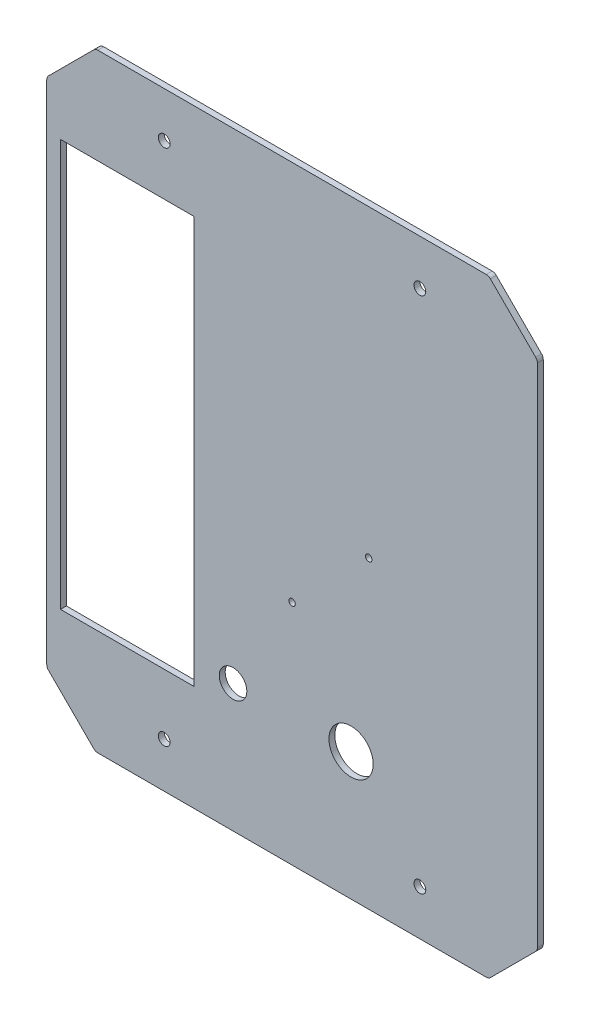
ISO-10303-21;
HEADER;
FILE_DESCRIPTION(('STEP AP214'),'2;1');
FILE_NAME('part.step','',(''),(''),'','','');
FILE_SCHEMA(('AUTOMOTIVE_DESIGN { 1 0 10303 214 1 1 1 1 }'));
ENDSEC;
DATA;
#1=APPLICATION_CONTEXT('core data for automotive mechanical design processes');
#2=APPLICATION_PROTOCOL_DEFINITION('international standard','automotive_design',2000,#1);
#3=PRODUCT_CONTEXT('',#1,'mechanical');
#4=PRODUCT('Part','Part','',(#3));
#5=PRODUCT_RELATED_PRODUCT_CATEGORY('part','',(#4));
#6=PRODUCT_DEFINITION_FORMATION('','',#4);
#7=PRODUCT_DEFINITION_CONTEXT('part definition',#1,'design');
#8=PRODUCT_DEFINITION('design','',#6,#7);
#9=PRODUCT_DEFINITION_SHAPE('','',#8);
#10=(LENGTH_UNIT() NAMED_UNIT(*) SI_UNIT(.MILLI.,.METRE.));
#11=(NAMED_UNIT(*) PLANE_ANGLE_UNIT() SI_UNIT($,.RADIAN.));
#12=(NAMED_UNIT(*) SI_UNIT($,.STERADIAN.) SOLID_ANGLE_UNIT());
#13=UNCERTAINTY_MEASURE_WITH_UNIT(LENGTH_MEASURE(1.E-05),#10,'distance_accuracy_value','');
#14=(GEOMETRIC_REPRESENTATION_CONTEXT(3) GLOBAL_UNCERTAINTY_ASSIGNED_CONTEXT((#13)) GLOBAL_UNIT_ASSIGNED_CONTEXT((#10,
#11,#12)) REPRESENTATION_CONTEXT('',''));
#15=CARTESIAN_POINT('',(0.,0.,0.));
#16=DIRECTION('',(0.,0.,1.));
#17=DIRECTION('',(1.,0.,0.));
#18=AXIS2_PLACEMENT_3D('',#15,#16,#17);
#19=CARTESIAN_POINT('',(24.7487373415291,24.7487373415292,3.));
#20=DIRECTION('',(-0.707106781186548,0.707106781186547,0.));
#21=DIRECTION('',(-0.707106781186547,-0.707106781186548,0.));
#22=AXIS2_PLACEMENT_3D('',#19,#20,#21);
#23=PLANE('',#22);
#24=DIRECTION('',(0.707106781186547,0.707106781186548,0.));
#25=VECTOR('',#24,1.);
#26=CARTESIAN_POINT('',(24.7487373415291,24.7487373415292,0.));
#27=LINE('',#26,#25);
#28=CARTESIAN_POINT('',(0.87867965644035,0.87867965644035,0.));
#29=VERTEX_POINT('',#28);
#30=CARTESIAN_POINT('',(23.8700576850888,23.8700576850888,0.));
#31=VERTEX_POINT('',#30);
#32=EDGE_CURVE('E259',#29,#31,#27,.T.);
#33=ORIENTED_EDGE('',*,*,#32,.T.);
#34=DIRECTION('',(0.,0.,-1.));
#35=VECTOR('',#34,1.);
#36=CARTESIAN_POINT('',(23.8700576850888,23.8700576850888,3.));
#37=LINE('',#36,#35);
#38=CARTESIAN_POINT('',(23.8700576850888,23.8700576850888,3.));
#39=VERTEX_POINT('',#38);
#40=EDGE_CURVE('E11',#31,#39,#37,.F.);
#41=ORIENTED_EDGE('',*,*,#40,.T.);
#42=DIRECTION('',(0.707106781186547,0.707106781186548,0.));
#43=VECTOR('',#42,1.);
#44=CARTESIAN_POINT('',(24.7487373415291,24.7487373415292,3.));
#45=LINE('',#44,#43);
#46=CARTESIAN_POINT('',(0.87867965644035,0.87867965644035,3.));
#47=VERTEX_POINT('',#46);
#48=EDGE_CURVE('E262',#47,#39,#45,.T.);
#49=ORIENTED_EDGE('',*,*,#48,.F.);
#50=DIRECTION('',(0.,0.,-1.));
#51=VECTOR('',#50,1.);
#52=CARTESIAN_POINT('',(0.87867965644035,0.878679656440354,3.));
#53=LINE('',#52,#51);
#54=EDGE_CURVE('E49',#47,#29,#53,.T.);
#55=ORIENTED_EDGE('',*,*,#54,.T.);
#56=EDGE_LOOP('',(#33,#41,#49,#55));
#57=FACE_BOUND('',#56,.T.);
#58=ADVANCED_FACE('F41',(#57),#23,.F.);
#59=CARTESIAN_POINT('',(24.7487373415291,284.748737341529,3.));
#60=DIRECTION('',(-1.,0.,0.));
#61=DIRECTION('',(0.,-1.,0.));
#62=AXIS2_PLACEMENT_3D('',#59,#60,#61);
#63=PLANE('',#62);
#64=DIRECTION('',(0.,1.,0.));
#65=VECTOR('',#64,1.);
#66=CARTESIAN_POINT('',(24.7487373415291,284.748737341529,0.));
#67=LINE('',#66,#65);
#68=CARTESIAN_POINT('',(24.7487373415291,25.9913780286485,0.));
#69=VERTEX_POINT('',#68);
#70=CARTESIAN_POINT('',(24.7487373415291,283.50609665441,0.));
#71=VERTEX_POINT('',#70);
#72=EDGE_CURVE('E290',#69,#71,#67,.T.);
#73=ORIENTED_EDGE('',*,*,#72,.T.);
#74=DIRECTION('',(0.,0.,-1.));
#75=VECTOR('',#74,1.);
#76=CARTESIAN_POINT('',(24.7487373415291,283.50609665441,3.));
#77=LINE('',#76,#75);
#78=CARTESIAN_POINT('',(24.7487373415291,283.50609665441,3.));
#79=VERTEX_POINT('',#78);
#80=EDGE_CURVE('E374',#71,#79,#77,.F.);
#81=ORIENTED_EDGE('',*,*,#80,.T.);
#82=DIRECTION('',(0.,1.,0.));
#83=VECTOR('',#82,1.);
#84=CARTESIAN_POINT('',(24.7487373415291,284.748737341529,3.));
#85=LINE('',#84,#83);
#86=CARTESIAN_POINT('',(24.7487373415291,25.9913780286485,3.));
#87=VERTEX_POINT('',#86);
#88=EDGE_CURVE('E265',#87,#79,#85,.T.);
#89=ORIENTED_EDGE('',*,*,#88,.F.);
#90=DIRECTION('',(0.,0.,-1.));
#91=VECTOR('',#90,1.);
#92=CARTESIAN_POINT('',(24.7487373415291,25.9913780286485,3.));
#93=LINE('',#92,#91);
#94=EDGE_CURVE('E371',#87,#69,#93,.T.);
#95=ORIENTED_EDGE('',*,*,#94,.T.);
#96=EDGE_LOOP('',(#73,#81,#89,#95));
#97=FACE_BOUND('',#96,.T.);
#98=ADVANCED_FACE('F393',(#97),#63,.F.);
#99=CARTESIAN_POINT('',(0.,309.497474683058,3.));
#100=DIRECTION('',(-0.707106781186547,-0.707106781186548,0.));
#101=DIRECTION('',(0.707106781186548,-0.707106781186547,0.));
#102=AXIS2_PLACEMENT_3D('',#99,#100,#101);
#103=PLANE('',#102);
#104=DIRECTION('',(-0.707106781186548,0.707106781186547,0.));
#105=VECTOR('',#104,1.);
#106=CARTESIAN_POINT('',(0.,309.497474683058,0.));
#107=LINE('',#106,#105);
#108=CARTESIAN_POINT('',(23.8700576850888,285.62741699797,0.));
#109=VERTEX_POINT('',#108);
#110=CARTESIAN_POINT('',(0.878679656440274,308.618795026618,0.));
#111=VERTEX_POINT('',#110);
#112=EDGE_CURVE('E293',#109,#111,#107,.T.);
#113=ORIENTED_EDGE('',*,*,#112,.T.);
#114=DIRECTION('',(0.,0.,-1.));
#115=VECTOR('',#114,1.);
#116=CARTESIAN_POINT('',(0.878679656440274,308.618795026618,3.));
#117=LINE('',#116,#115);
#118=CARTESIAN_POINT('',(0.878679656440274,308.618795026618,3.));
#119=VERTEX_POINT('',#118);
#120=EDGE_CURVE('E369',#111,#119,#117,.F.);
#121=ORIENTED_EDGE('',*,*,#120,.T.);
#122=DIRECTION('',(-0.707106781186548,0.707106781186547,0.));
#123=VECTOR('',#122,1.);
#124=CARTESIAN_POINT('',(0.,309.497474683058,3.));
#125=LINE('',#124,#123);
#126=CARTESIAN_POINT('',(23.8700576850888,285.62741699797,3.));
#127=VERTEX_POINT('',#126);
#128=EDGE_CURVE('E269',#127,#119,#125,.T.);
#129=ORIENTED_EDGE('',*,*,#128,.F.);
#130=DIRECTION('',(0.,0.,-1.));
#131=VECTOR('',#130,1.);
#132=CARTESIAN_POINT('',(23.8700576850888,285.62741699797,3.));
#133=LINE('',#132,#131);
#134=EDGE_CURVE('E366',#127,#109,#133,.T.);
#135=ORIENTED_EDGE('',*,*,#134,.T.);
#136=EDGE_LOOP('',(#113,#121,#129,#135));
#137=FACE_BOUND('',#136,.T.);
#138=ADVANCED_FACE('F403',(#137),#103,.F.);
#139=CARTESIAN_POINT('',(-200.,309.497474683058,3.));
#140=DIRECTION('',(0.,-1.,0.));
#141=DIRECTION('',(0.,0.,-1.));
#142=AXIS2_PLACEMENT_3D('',#139,#140,#141);
#143=PLANE('',#142);
#144=DIRECTION('',(-1.,0.,0.));
#145=VECTOR('',#144,1.);
#146=CARTESIAN_POINT('',(-200.,309.497474683058,0.));
#147=LINE('',#146,#145);
#148=CARTESIAN_POINT('',(-1.24264068711938,309.497474683058,0.));
#149=VERTEX_POINT('',#148);
#150=CARTESIAN_POINT('',(-198.757359312881,309.497474683058,0.));
#151=VERTEX_POINT('',#150);
#152=EDGE_CURVE('E296',#149,#151,#147,.T.);
#153=ORIENTED_EDGE('',*,*,#152,.T.);
#154=DIRECTION('',(0.,0.,-1.));
#155=VECTOR('',#154,1.);
#156=CARTESIAN_POINT('',(-198.757359312881,309.497474683058,3.));
#157=LINE('',#156,#155);
#158=CARTESIAN_POINT('',(-198.757359312881,309.497474683058,3.));
#159=VERTEX_POINT('',#158);
#160=EDGE_CURVE('E364',#151,#159,#157,.F.);
#161=ORIENTED_EDGE('',*,*,#160,.T.);
#162=DIRECTION('',(-1.,0.,0.));
#163=VECTOR('',#162,1.);
#164=CARTESIAN_POINT('',(-200.,309.497474683058,3.));
#165=LINE('',#164,#163);
#166=CARTESIAN_POINT('',(-1.24264068711938,309.497474683058,3.));
#167=VERTEX_POINT('',#166);
#168=EDGE_CURVE('E272',#167,#159,#165,.T.);
#169=ORIENTED_EDGE('',*,*,#168,.F.);
#170=DIRECTION('',(0.,0.,-1.));
#171=VECTOR('',#170,1.);
#172=CARTESIAN_POINT('',(-1.24264068711938,309.497474683058,3.));
#173=LINE('',#172,#171);
#174=EDGE_CURVE('E361',#167,#149,#173,.T.);
#175=ORIENTED_EDGE('',*,*,#174,.T.);
#176=EDGE_LOOP('',(#153,#161,#169,#175));
#177=FACE_BOUND('',#176,.T.);
#178=ADVANCED_FACE('F412',(#177),#143,.F.);
#179=CARTESIAN_POINT('',(-224.748737341529,284.748737341529,3.));
#180=DIRECTION('',(0.707106781186549,-0.707106781186546,0.));
#181=DIRECTION('',(0.707106781186546,0.707106781186549,0.));
#182=AXIS2_PLACEMENT_3D('',#179,#180,#181);
#183=PLANE('',#182);
#184=DIRECTION('',(-0.707106781186546,-0.707106781186549,0.));
#185=VECTOR('',#184,1.);
#186=CARTESIAN_POINT('',(-224.748737341529,284.748737341529,0.));
#187=LINE('',#186,#185);
#188=CARTESIAN_POINT('',(-200.87867965644,308.618795026618,0.));
#189=VERTEX_POINT('',#188);
#190=CARTESIAN_POINT('',(-223.870057685089,285.62741699797,0.));
#191=VERTEX_POINT('',#190);
#192=EDGE_CURVE('E299',#189,#191,#187,.T.);
#193=ORIENTED_EDGE('',*,*,#192,.T.);
#194=DIRECTION('',(0.,0.,-1.));
#195=VECTOR('',#194,1.);
#196=CARTESIAN_POINT('',(-223.870057685089,285.62741699797,3.));
#197=LINE('',#196,#195);
#198=CARTESIAN_POINT('',(-223.870057685089,285.62741699797,3.));
#199=VERTEX_POINT('',#198);
#200=EDGE_CURVE('E359',#191,#199,#197,.F.);
#201=ORIENTED_EDGE('',*,*,#200,.T.);
#202=DIRECTION('',(-0.707106781186546,-0.707106781186549,0.));
#203=VECTOR('',#202,1.);
#204=CARTESIAN_POINT('',(-224.748737341529,284.748737341529,3.));
#205=LINE('',#204,#203);
#206=CARTESIAN_POINT('',(-200.87867965644,308.618795026618,3.));
#207=VERTEX_POINT('',#206);
#208=EDGE_CURVE('E275',#207,#199,#205,.T.);
#209=ORIENTED_EDGE('',*,*,#208,.F.);
#210=DIRECTION('',(0.,0.,-1.));
#211=VECTOR('',#210,1.);
#212=CARTESIAN_POINT('',(-200.87867965644,308.618795026618,3.));
#213=LINE('',#212,#211);
#214=EDGE_CURVE('E356',#207,#189,#213,.T.);
#215=ORIENTED_EDGE('',*,*,#214,.T.);
#216=EDGE_LOOP('',(#193,#201,#209,#215));
#217=FACE_BOUND('',#216,.T.);
#218=ADVANCED_FACE('F421',(#217),#183,.F.);
#219=CARTESIAN_POINT('',(-224.748737341529,24.7487373415292,3.));
#220=DIRECTION('',(1.,0.,0.));
#221=DIRECTION('',(0.,1.,0.));
#222=AXIS2_PLACEMENT_3D('',#219,#220,#221);
#223=PLANE('',#222);
#224=DIRECTION('',(0.,-1.,0.));
#225=VECTOR('',#224,1.);
#226=CARTESIAN_POINT('',(-224.748737341529,24.7487373415292,0.));
#227=LINE('',#226,#225);
#228=CARTESIAN_POINT('',(-224.748737341529,283.50609665441,0.));
#229=VERTEX_POINT('',#228);
#230=CARTESIAN_POINT('',(-224.748737341529,25.9913780286484,0.));
#231=VERTEX_POINT('',#230);
#232=EDGE_CURVE('E302',#229,#231,#227,.T.);
#233=ORIENTED_EDGE('',*,*,#232,.T.);
#234=DIRECTION('',(0.,0.,-1.));
#235=VECTOR('',#234,1.);
#236=CARTESIAN_POINT('',(-224.748737341529,25.9913780286484,3.));
#237=LINE('',#236,#235);
#238=CARTESIAN_POINT('',(-224.748737341529,25.9913780286484,3.));
#239=VERTEX_POINT('',#238);
#240=EDGE_CURVE('E354',#231,#239,#237,.F.);
#241=ORIENTED_EDGE('',*,*,#240,.T.);
#242=DIRECTION('',(0.,-1.,0.));
#243=VECTOR('',#242,1.);
#244=CARTESIAN_POINT('',(-224.748737341529,24.7487373415292,3.));
#245=LINE('',#244,#243);
#246=CARTESIAN_POINT('',(-224.748737341529,283.50609665441,3.));
#247=VERTEX_POINT('',#246);
#248=EDGE_CURVE('E278',#247,#239,#245,.T.);
#249=ORIENTED_EDGE('',*,*,#248,.F.);
#250=DIRECTION('',(0.,0.,-1.));
#251=VECTOR('',#250,1.);
#252=CARTESIAN_POINT('',(-224.748737341529,283.50609665441,3.));
#253=LINE('',#252,#251);
#254=EDGE_CURVE('E351',#247,#229,#253,.T.);
#255=ORIENTED_EDGE('',*,*,#254,.T.);
#256=EDGE_LOOP('',(#233,#241,#249,#255));
#257=FACE_BOUND('',#256,.T.);
#258=ADVANCED_FACE('F430',(#257),#223,.F.);
#259=CARTESIAN_POINT('',(-200.,0.,3.));
#260=DIRECTION('',(0.707106781186547,0.707106781186548,0.));
#261=DIRECTION('',(-0.707106781186548,0.707106781186547,0.));
#262=AXIS2_PLACEMENT_3D('',#259,#260,#261);
#263=PLANE('',#262);
#264=DIRECTION('',(0.707106781186548,-0.707106781186547,0.));
#265=VECTOR('',#264,1.);
#266=CARTESIAN_POINT('',(-200.,0.,0.));
#267=LINE('',#266,#265);
#268=CARTESIAN_POINT('',(-223.870057685089,23.8700576850888,0.));
#269=VERTEX_POINT('',#268);
#270=CARTESIAN_POINT('',(-200.87867965644,0.878679656440342,0.));
#271=VERTEX_POINT('',#270);
#272=EDGE_CURVE('E305',#269,#271,#267,.T.);
#273=ORIENTED_EDGE('',*,*,#272,.T.);
#274=DIRECTION('',(0.,0.,-1.));
#275=VECTOR('',#274,1.);
#276=CARTESIAN_POINT('',(-200.87867965644,0.878679656440346,3.));
#277=LINE('',#276,#275);
#278=CARTESIAN_POINT('',(-200.87867965644,0.878679656440342,3.));
#279=VERTEX_POINT('',#278);
#280=EDGE_CURVE('E333',#271,#279,#277,.F.);
#281=ORIENTED_EDGE('',*,*,#280,.T.);
#282=DIRECTION('',(0.707106781186548,-0.707106781186547,0.));
#283=VECTOR('',#282,1.);
#284=CARTESIAN_POINT('',(-200.,0.,3.));
#285=LINE('',#284,#283);
#286=CARTESIAN_POINT('',(-223.870057685089,23.8700576850888,3.));
#287=VERTEX_POINT('',#286);
#288=EDGE_CURVE('E281',#287,#279,#285,.T.);
#289=ORIENTED_EDGE('',*,*,#288,.F.);
#290=DIRECTION('',(0.,0.,-1.));
#291=VECTOR('',#290,1.);
#292=CARTESIAN_POINT('',(-223.870057685089,23.8700576850888,3.));
#293=LINE('',#292,#291);
#294=EDGE_CURVE('E330',#287,#269,#293,.T.);
#295=ORIENTED_EDGE('',*,*,#294,.T.);
#296=EDGE_LOOP('',(#273,#281,#289,#295));
#297=FACE_BOUND('',#296,.T.);
#298=ADVANCED_FACE('F439',(#297),#263,.F.);
#299=CARTESIAN_POINT('',(0.,0.,3.));
#300=DIRECTION('',(0.,1.,0.));
#301=DIRECTION('',(0.,0.,1.));
#302=AXIS2_PLACEMENT_3D('',#299,#300,#301);
#303=PLANE('',#302);
#304=DIRECTION('',(1.,0.,0.));
#305=VECTOR('',#304,1.);
#306=CARTESIAN_POINT('',(0.,0.,3.));
#307=LINE('',#306,#305);
#308=CARTESIAN_POINT('',(-198.757359312881,0.,3.));
#309=VERTEX_POINT('',#308);
#310=CARTESIAN_POINT('',(-1.2426406871193,0.,3.));
#311=VERTEX_POINT('',#310);
#312=EDGE_CURVE('E284',#309,#311,#307,.T.);
#313=ORIENTED_EDGE('',*,*,#312,.F.);
#314=DIRECTION('',(0.,0.,-1.));
#315=VECTOR('',#314,1.);
#316=CARTESIAN_POINT('',(-198.757359312881,0.,3.));
#317=LINE('',#316,#315);
#318=CARTESIAN_POINT('',(-198.757359312881,0.,0.));
#319=VERTEX_POINT('',#318);
#320=EDGE_CURVE('E311',#309,#319,#317,.T.);
#321=ORIENTED_EDGE('',*,*,#320,.T.);
#322=DIRECTION('',(1.,0.,0.));
#323=VECTOR('',#322,1.);
#324=CARTESIAN_POINT('',(0.,0.,0.));
#325=LINE('',#324,#323);
#326=CARTESIAN_POINT('',(-1.2426406871193,0.,0.));
#327=VERTEX_POINT('',#326);
#328=EDGE_CURVE('E266',#319,#327,#325,.T.);
#329=ORIENTED_EDGE('',*,*,#328,.T.);
#330=DIRECTION('',(0.,0.,-1.));
#331=VECTOR('',#330,1.);
#332=CARTESIAN_POINT('',(-1.2426406871193,0.,3.));
#333=LINE('',#332,#331);
#334=EDGE_CURVE('E287',#327,#311,#333,.F.);
#335=ORIENTED_EDGE('',*,*,#334,.T.);
#336=EDGE_LOOP('',(#313,#321,#329,#335));
#337=FACE_BOUND('',#336,.T.);
#338=ADVANCED_FACE('F447',(#337),#303,.F.);
#339=CARTESIAN_POINT('',(0.,0.,3.));
#340=DIRECTION('',(0.,0.,-1.));
#341=DIRECTION('',(-1.,0.,0.));
#342=AXIS2_PLACEMENT_3D('',#339,#340,#341);
#343=PLANE('',#342);
#344=DIRECTION('',(1.,0.,0.));
#345=VECTOR('',#344,1.);
#346=CARTESIAN_POINT('',(-149.744364822052,260.741556093661,3.));
#347=LINE('',#346,#345);
#348=CARTESIAN_POINT('',(-217.744364822052,260.741556093661,3.));
#349=VERTEX_POINT('',#348);
#350=CARTESIAN_POINT('',(-149.744364822052,260.741556093661,3.));
#351=VERTEX_POINT('',#350);
#352=EDGE_CURVE('E185',#349,#351,#347,.T.);
#353=ORIENTED_EDGE('',*,*,#352,.T.);
#354=DIRECTION('',(0.,-1.,0.));
#355=VECTOR('',#354,1.);
#356=CARTESIAN_POINT('',(-149.744364822052,260.741556093661,3.));
#357=LINE('',#356,#355);
#358=CARTESIAN_POINT('',(-149.744364822052,53.7415560936608,3.));
#359=VERTEX_POINT('',#358);
#360=EDGE_CURVE('E179',#351,#359,#357,.T.);
#361=ORIENTED_EDGE('',*,*,#360,.T.);
#362=DIRECTION('',(-1.,0.,0.));
#363=VECTOR('',#362,1.);
#364=CARTESIAN_POINT('',(-149.744364822052,53.7415560936608,3.));
#365=LINE('',#364,#363);
#366=CARTESIAN_POINT('',(-217.744364822052,53.7415560936608,3.));
#367=VERTEX_POINT('',#366);
#368=EDGE_CURVE('E188',#359,#367,#365,.T.);
#369=ORIENTED_EDGE('',*,*,#368,.T.);
#370=DIRECTION('',(0.,1.,0.));
#371=VECTOR('',#370,1.);
#372=CARTESIAN_POINT('',(-217.744364822052,260.741556093661,3.));
#373=LINE('',#372,#371);
#374=EDGE_CURVE('E56',#367,#349,#373,.T.);
#375=ORIENTED_EDGE('',*,*,#374,.T.);
#376=EDGE_LOOP('',(#353,#361,#369,#375));
#377=FACE_BOUND('',#376,.T.);
#378=CARTESIAN_POINT('',(-130.,65.,3.));
#379=DIRECTION('',(0.,0.,-1.));
#380=DIRECTION('',(-1.,0.,0.));
#381=AXIS2_PLACEMENT_3D('',#378,#379,#380);
#382=CIRCLE('',#381,7.00000000000002);
#383=CARTESIAN_POINT('',(-137.,65.,3.));
#384=VERTEX_POINT('',#383);
#385=EDGE_CURVE('E214',#384,#384,#382,.T.);
#386=ORIENTED_EDGE('',*,*,#385,.T.);
#387=EDGE_LOOP('',(#386));
#388=FACE_BOUND('',#387,.T.);
#389=CARTESIAN_POINT('',(-70.0000000000001,65.,3.));
#390=DIRECTION('',(0.,0.,-1.));
#391=DIRECTION('',(-1.,0.,0.));
#392=AXIS2_PLACEMENT_3D('',#389,#390,#391);
#393=CIRCLE('',#392,11.25);
#394=CARTESIAN_POINT('',(-81.2500000000001,65.,3.));
#395=VERTEX_POINT('',#394);
#396=EDGE_CURVE('E220',#395,#395,#393,.T.);
#397=ORIENTED_EDGE('',*,*,#396,.T.);
#398=EDGE_LOOP('',(#397));
#399=FACE_BOUND('',#398,.T.);
#400=CARTESIAN_POINT('',(-61.,154.748737341529,3.));
#401=DIRECTION('',(0.,0.,-1.));
#402=DIRECTION('',(-1.,0.,0.));
#403=AXIS2_PLACEMENT_3D('',#400,#401,#402);
#404=CIRCLE('',#403,1.65000000000001);
#405=CARTESIAN_POINT('',(-62.65,154.748737341529,3.));
#406=VERTEX_POINT('',#405);
#407=EDGE_CURVE('E226',#406,#406,#404,.T.);
#408=ORIENTED_EDGE('',*,*,#407,.T.);
#409=EDGE_LOOP('',(#408));
#410=FACE_BOUND('',#409,.T.);
#411=CARTESIAN_POINT('',(-100.,115.748737341529,3.));
#412=DIRECTION('',(0.,0.,-1.));
#413=DIRECTION('',(-1.,0.,0.));
#414=AXIS2_PLACEMENT_3D('',#411,#412,#413);
#415=CIRCLE('',#414,1.65);
#416=CARTESIAN_POINT('',(-101.65,115.748737341529,3.));
#417=VERTEX_POINT('',#416);
#418=EDGE_CURVE('E223',#417,#417,#415,.T.);
#419=ORIENTED_EDGE('',*,*,#418,.T.);
#420=EDGE_LOOP('',(#419));
#421=FACE_BOUND('',#420,.T.);
#422=CARTESIAN_POINT('',(-35.,23.,3.));
#423=DIRECTION('',(0.,0.,-1.));
#424=DIRECTION('',(1.,0.,0.));
#425=AXIS2_PLACEMENT_3D('',#422,#423,#424);
#426=CIRCLE('',#425,3.);
#427=CARTESIAN_POINT('',(-32.,23.,3.));
#428=VERTEX_POINT('',#427);
#429=EDGE_CURVE('E229',#428,#428,#426,.T.);
#430=ORIENTED_EDGE('',*,*,#429,.T.);
#431=EDGE_LOOP('',(#430));
#432=FACE_BOUND('',#431,.T.);
#433=CARTESIAN_POINT('',(-165.,23.,3.));
#434=DIRECTION('',(0.,0.,-1.));
#435=DIRECTION('',(-1.,0.,0.));
#436=AXIS2_PLACEMENT_3D('',#433,#434,#435);
#437=CIRCLE('',#436,3.00000000000002);
#438=CARTESIAN_POINT('',(-168.,23.,3.));
#439=VERTEX_POINT('',#438);
#440=EDGE_CURVE('E248',#439,#439,#437,.T.);
#441=ORIENTED_EDGE('',*,*,#440,.T.);
#442=EDGE_LOOP('',(#441));
#443=FACE_BOUND('',#442,.T.);
#444=CARTESIAN_POINT('',(-165.,286.497474683058,3.));
#445=DIRECTION('',(0.,0.,-1.));
#446=DIRECTION('',(1.,0.,0.));
#447=AXIS2_PLACEMENT_3D('',#444,#445,#446);
#448=CIRCLE('',#447,3.00000000000002);
#449=CARTESIAN_POINT('',(-162.,286.497474683058,3.));
#450=VERTEX_POINT('',#449);
#451=EDGE_CURVE('E242',#450,#450,#448,.T.);
#452=ORIENTED_EDGE('',*,*,#451,.T.);
#453=EDGE_LOOP('',(#452));
#454=FACE_BOUND('',#453,.T.);
#455=CARTESIAN_POINT('',(-35.0000000000001,286.497474683058,3.));
#456=DIRECTION('',(0.,0.,-1.));
#457=DIRECTION('',(-1.,0.,0.));
#458=AXIS2_PLACEMENT_3D('',#455,#456,#457);
#459=CIRCLE('',#458,3.);
#460=CARTESIAN_POINT('',(-38.0000000000001,286.497474683058,3.));
#461=VERTEX_POINT('',#460);
#462=EDGE_CURVE('E256',#461,#461,#459,.T.);
#463=ORIENTED_EDGE('',*,*,#462,.T.);
#464=EDGE_LOOP('',(#463));
#465=FACE_BOUND('',#464,.T.);
#466=ORIENTED_EDGE('',*,*,#288,.T.);
#467=CARTESIAN_POINT('',(-198.757359312881,3.,3.));
#468=DIRECTION('',(0.,0.,-1.));
#469=DIRECTION('',(-1.,0.,0.));
#470=AXIS2_PLACEMENT_3D('',#467,#468,#469);
#471=CIRCLE('',#470,3.);
#472=EDGE_CURVE('E349',#279,#309,#471,.F.);
#473=ORIENTED_EDGE('',*,*,#472,.T.);
#474=ORIENTED_EDGE('',*,*,#312,.T.);
#475=CARTESIAN_POINT('',(-1.2426406871193,3.,3.));
#476=DIRECTION('',(0.,0.,-1.));
#477=DIRECTION('',(-1.,0.,0.));
#478=AXIS2_PLACEMENT_3D('',#475,#476,#477);
#479=CIRCLE('',#478,3.);
#480=EDGE_CURVE('E335',#311,#47,#479,.F.);
#481=ORIENTED_EDGE('',*,*,#480,.T.);
#482=ORIENTED_EDGE('',*,*,#48,.T.);
#483=CARTESIAN_POINT('',(21.7487373415291,25.9913780286485,3.));
#484=DIRECTION('',(0.,0.,-1.));
#485=DIRECTION('',(-1.,0.,0.));
#486=AXIS2_PLACEMENT_3D('',#483,#484,#485);
#487=CIRCLE('',#486,3.);
#488=EDGE_CURVE('E337',#39,#87,#487,.F.);
#489=ORIENTED_EDGE('',*,*,#488,.T.);
#490=ORIENTED_EDGE('',*,*,#88,.T.);
#491=CARTESIAN_POINT('',(21.7487373415291,283.50609665441,3.));
#492=DIRECTION('',(0.,0.,-1.));
#493=DIRECTION('',(-1.,0.,0.));
#494=AXIS2_PLACEMENT_3D('',#491,#492,#493);
#495=CIRCLE('',#494,3.);
#496=EDGE_CURVE('E339',#79,#127,#495,.F.);
#497=ORIENTED_EDGE('',*,*,#496,.T.);
#498=ORIENTED_EDGE('',*,*,#128,.T.);
#499=CARTESIAN_POINT('',(-1.24264068711938,306.497474683058,3.));
#500=DIRECTION('',(0.,0.,-1.));
#501=DIRECTION('',(-1.,0.,0.));
#502=AXIS2_PLACEMENT_3D('',#499,#500,#501);
#503=CIRCLE('',#502,3.);
#504=EDGE_CURVE('E341',#119,#167,#503,.F.);
#505=ORIENTED_EDGE('',*,*,#504,.T.);
#506=ORIENTED_EDGE('',*,*,#168,.T.);
#507=CARTESIAN_POINT('',(-198.757359312881,306.497474683058,3.));
#508=DIRECTION('',(0.,0.,-1.));
#509=DIRECTION('',(-1.,0.,0.));
#510=AXIS2_PLACEMENT_3D('',#507,#508,#509);
#511=CIRCLE('',#510,3.);
#512=EDGE_CURVE('E343',#159,#207,#511,.F.);
#513=ORIENTED_EDGE('',*,*,#512,.T.);
#514=ORIENTED_EDGE('',*,*,#208,.T.);
#515=CARTESIAN_POINT('',(-221.748737341529,283.50609665441,3.));
#516=DIRECTION('',(0.,0.,-1.));
#517=DIRECTION('',(-1.,0.,0.));
#518=AXIS2_PLACEMENT_3D('',#515,#516,#517);
#519=CIRCLE('',#518,3.);
#520=EDGE_CURVE('E345',#199,#247,#519,.F.);
#521=ORIENTED_EDGE('',*,*,#520,.T.);
#522=ORIENTED_EDGE('',*,*,#248,.T.);
#523=CARTESIAN_POINT('',(-221.748737341529,25.9913780286484,3.));
#524=DIRECTION('',(0.,0.,-1.));
#525=DIRECTION('',(-1.,0.,0.));
#526=AXIS2_PLACEMENT_3D('',#523,#524,#525);
#527=CIRCLE('',#526,3.);
#528=EDGE_CURVE('E347',#239,#287,#527,.F.);
#529=ORIENTED_EDGE('',*,*,#528,.T.);
#530=EDGE_LOOP('',(#466,#473,#474,#481,#482,#489,#490,#497,#498,#505,#506,#513,#514,#521,#522,#529));
#531=FACE_BOUND('',#530,.T.);
#532=ADVANCED_FACE('F192',(#377,#388,#399,#410,#421,#432,#443,#454,#465,#531),#343,.F.);
#533=CARTESIAN_POINT('',(0.,0.,0.));
#534=DIRECTION('',(0.,0.,-1.));
#535=DIRECTION('',(-1.,0.,0.));
#536=AXIS2_PLACEMENT_3D('',#533,#534,#535);
#537=PLANE('',#536);
#538=DIRECTION('',(0.,-1.,0.));
#539=VECTOR('',#538,1.);
#540=CARTESIAN_POINT('',(-149.744364822052,260.741556093661,0.));
#541=LINE('',#540,#539);
#542=CARTESIAN_POINT('',(-149.744364822052,260.741556093661,0.));
#543=VERTEX_POINT('',#542);
#544=CARTESIAN_POINT('',(-149.744364822052,53.7415560936608,0.));
#545=VERTEX_POINT('',#544);
#546=EDGE_CURVE('E64',#543,#545,#541,.T.);
#547=ORIENTED_EDGE('',*,*,#546,.F.);
#548=DIRECTION('',(1.,0.,0.));
#549=VECTOR('',#548,1.);
#550=CARTESIAN_POINT('',(-149.744364822052,260.741556093661,0.));
#551=LINE('',#550,#549);
#552=CARTESIAN_POINT('',(-217.744364822052,260.741556093661,0.));
#553=VERTEX_POINT('',#552);
#554=EDGE_CURVE('E195',#553,#543,#551,.T.);
#555=ORIENTED_EDGE('',*,*,#554,.F.);
#556=DIRECTION('',(0.,1.,0.));
#557=VECTOR('',#556,1.);
#558=CARTESIAN_POINT('',(-217.744364822052,260.741556093661,0.));
#559=LINE('',#558,#557);
#560=CARTESIAN_POINT('',(-217.744364822052,53.7415560936608,0.));
#561=VERTEX_POINT('',#560);
#562=EDGE_CURVE('E198',#561,#553,#559,.T.);
#563=ORIENTED_EDGE('',*,*,#562,.F.);
#564=DIRECTION('',(-1.,0.,0.));
#565=VECTOR('',#564,1.);
#566=CARTESIAN_POINT('',(-149.744364822052,53.7415560936608,0.));
#567=LINE('',#566,#565);
#568=EDGE_CURVE('E204',#545,#561,#567,.T.);
#569=ORIENTED_EDGE('',*,*,#568,.F.);
#570=EDGE_LOOP('',(#547,#555,#563,#569));
#571=FACE_BOUND('',#570,.T.);
#572=CARTESIAN_POINT('',(-130.,65.,0.));
#573=DIRECTION('',(0.,0.,-1.));
#574=DIRECTION('',(-1.,0.,0.));
#575=AXIS2_PLACEMENT_3D('',#572,#573,#574);
#576=CIRCLE('',#575,7.00000000000002);
#577=CARTESIAN_POINT('',(-137.,65.,0.));
#578=VERTEX_POINT('',#577);
#579=EDGE_CURVE('E210',#578,#578,#576,.T.);
#580=ORIENTED_EDGE('',*,*,#579,.F.);
#581=EDGE_LOOP('',(#580));
#582=FACE_BOUND('',#581,.T.);
#583=CARTESIAN_POINT('',(-70.0000000000001,65.,0.));
#584=DIRECTION('',(0.,0.,-1.));
#585=DIRECTION('',(-1.,0.,0.));
#586=AXIS2_PLACEMENT_3D('',#583,#584,#585);
#587=CIRCLE('',#586,11.25);
#588=CARTESIAN_POINT('',(-81.2500000000001,65.,0.));
#589=VERTEX_POINT('',#588);
#590=EDGE_CURVE('E217',#589,#589,#587,.T.);
#591=ORIENTED_EDGE('',*,*,#590,.F.);
#592=EDGE_LOOP('',(#591));
#593=FACE_BOUND('',#592,.T.);
#594=CARTESIAN_POINT('',(-61.,154.748737341529,0.));
#595=DIRECTION('',(0.,0.,-1.));
#596=DIRECTION('',(-1.,0.,0.));
#597=AXIS2_PLACEMENT_3D('',#594,#595,#596);
#598=CIRCLE('',#597,1.65000000000001);
#599=CARTESIAN_POINT('',(-62.65,154.748737341529,0.));
#600=VERTEX_POINT('',#599);
#601=EDGE_CURVE('E230',#600,#600,#598,.T.);
#602=ORIENTED_EDGE('',*,*,#601,.F.);
#603=EDGE_LOOP('',(#602));
#604=FACE_BOUND('',#603,.T.);
#605=CARTESIAN_POINT('',(-100.,115.748737341529,0.));
#606=DIRECTION('',(0.,0.,-1.));
#607=DIRECTION('',(-1.,0.,0.));
#608=AXIS2_PLACEMENT_3D('',#605,#606,#607);
#609=CIRCLE('',#608,1.65);
#610=CARTESIAN_POINT('',(-101.65,115.748737341529,0.));
#611=VERTEX_POINT('',#610);
#612=EDGE_CURVE('E233',#611,#611,#609,.T.);
#613=ORIENTED_EDGE('',*,*,#612,.F.);
#614=EDGE_LOOP('',(#613));
#615=FACE_BOUND('',#614,.T.);
#616=CARTESIAN_POINT('',(-35.,23.,0.));
#617=DIRECTION('',(0.,0.,-1.));
#618=DIRECTION('',(1.,0.,0.));
#619=AXIS2_PLACEMENT_3D('',#616,#617,#618);
#620=CIRCLE('',#619,3.);
#621=CARTESIAN_POINT('',(-32.,23.,0.));
#622=VERTEX_POINT('',#621);
#623=EDGE_CURVE('E251',#622,#622,#620,.T.);
#624=ORIENTED_EDGE('',*,*,#623,.F.);
#625=EDGE_LOOP('',(#624));
#626=FACE_BOUND('',#625,.T.);
#627=CARTESIAN_POINT('',(-165.,23.,0.));
#628=DIRECTION('',(0.,0.,-1.));
#629=DIRECTION('',(-1.,0.,0.));
#630=AXIS2_PLACEMENT_3D('',#627,#628,#629);
#631=CIRCLE('',#630,3.00000000000002);
#632=CARTESIAN_POINT('',(-168.,23.,0.));
#633=VERTEX_POINT('',#632);
#634=EDGE_CURVE('E245',#633,#633,#631,.T.);
#635=ORIENTED_EDGE('',*,*,#634,.F.);
#636=EDGE_LOOP('',(#635));
#637=FACE_BOUND('',#636,.T.);
#638=CARTESIAN_POINT('',(-165.,286.497474683058,0.));
#639=DIRECTION('',(0.,0.,-1.));
#640=DIRECTION('',(1.,0.,0.));
#641=AXIS2_PLACEMENT_3D('',#638,#639,#640);
#642=CIRCLE('',#641,3.00000000000002);
#643=CARTESIAN_POINT('',(-162.,286.497474683058,0.));
#644=VERTEX_POINT('',#643);
#645=EDGE_CURVE('E238',#644,#644,#642,.T.);
#646=ORIENTED_EDGE('',*,*,#645,.F.);
#647=EDGE_LOOP('',(#646));
#648=FACE_BOUND('',#647,.T.);
#649=CARTESIAN_POINT('',(-35.0000000000001,286.497474683058,0.));
#650=DIRECTION('',(0.,0.,-1.));
#651=DIRECTION('',(-1.,0.,0.));
#652=AXIS2_PLACEMENT_3D('',#649,#650,#651);
#653=CIRCLE('',#652,3.);
#654=CARTESIAN_POINT('',(-38.0000000000001,286.497474683058,0.));
#655=VERTEX_POINT('',#654);
#656=EDGE_CURVE('E241',#655,#655,#653,.T.);
#657=ORIENTED_EDGE('',*,*,#656,.F.);
#658=EDGE_LOOP('',(#657));
#659=FACE_BOUND('',#658,.T.);
#660=ORIENTED_EDGE('',*,*,#328,.F.);
#661=CARTESIAN_POINT('',(-198.757359312881,3.,0.));
#662=DIRECTION('',(0.,0.,-1.));
#663=DIRECTION('',(-1.,0.,0.));
#664=AXIS2_PLACEMENT_3D('',#661,#662,#663);
#665=CIRCLE('',#664,3.);
#666=EDGE_CURVE('E328',#319,#271,#665,.T.);
#667=ORIENTED_EDGE('',*,*,#666,.T.);
#668=ORIENTED_EDGE('',*,*,#272,.F.);
#669=CARTESIAN_POINT('',(-221.748737341529,25.9913780286484,0.));
#670=DIRECTION('',(0.,0.,-1.));
#671=DIRECTION('',(-1.,0.,0.));
#672=AXIS2_PLACEMENT_3D('',#669,#670,#671);
#673=CIRCLE('',#672,3.);
#674=EDGE_CURVE('E326',#269,#231,#673,.T.);
#675=ORIENTED_EDGE('',*,*,#674,.T.);
#676=ORIENTED_EDGE('',*,*,#232,.F.);
#677=CARTESIAN_POINT('',(-221.748737341529,283.50609665441,0.));
#678=DIRECTION('',(0.,0.,-1.));
#679=DIRECTION('',(-1.,0.,0.));
#680=AXIS2_PLACEMENT_3D('',#677,#678,#679);
#681=CIRCLE('',#680,3.);
#682=EDGE_CURVE('E324',#229,#191,#681,.T.);
#683=ORIENTED_EDGE('',*,*,#682,.T.);
#684=ORIENTED_EDGE('',*,*,#192,.F.);
#685=CARTESIAN_POINT('',(-198.757359312881,306.497474683058,0.));
#686=DIRECTION('',(0.,0.,-1.));
#687=DIRECTION('',(-1.,0.,0.));
#688=AXIS2_PLACEMENT_3D('',#685,#686,#687);
#689=CIRCLE('',#688,3.);
#690=EDGE_CURVE('E322',#189,#151,#689,.T.);
#691=ORIENTED_EDGE('',*,*,#690,.T.);
#692=ORIENTED_EDGE('',*,*,#152,.F.);
#693=CARTESIAN_POINT('',(-1.24264068711938,306.497474683058,0.));
#694=DIRECTION('',(0.,0.,-1.));
#695=DIRECTION('',(-1.,0.,0.));
#696=AXIS2_PLACEMENT_3D('',#693,#694,#695);
#697=CIRCLE('',#696,3.);
#698=EDGE_CURVE('E320',#149,#111,#697,.T.);
#699=ORIENTED_EDGE('',*,*,#698,.T.);
#700=ORIENTED_EDGE('',*,*,#112,.F.);
#701=CARTESIAN_POINT('',(21.7487373415291,283.50609665441,0.));
#702=DIRECTION('',(0.,0.,-1.));
#703=DIRECTION('',(-1.,0.,0.));
#704=AXIS2_PLACEMENT_3D('',#701,#702,#703);
#705=CIRCLE('',#704,3.);
#706=EDGE_CURVE('E318',#109,#71,#705,.T.);
#707=ORIENTED_EDGE('',*,*,#706,.T.);
#708=ORIENTED_EDGE('',*,*,#72,.F.);
#709=CARTESIAN_POINT('',(21.7487373415291,25.9913780286485,0.));
#710=DIRECTION('',(0.,0.,-1.));
#711=DIRECTION('',(-1.,0.,0.));
#712=AXIS2_PLACEMENT_3D('',#709,#710,#711);
#713=CIRCLE('',#712,3.);
#714=EDGE_CURVE('E316',#69,#31,#713,.T.);
#715=ORIENTED_EDGE('',*,*,#714,.T.);
#716=ORIENTED_EDGE('',*,*,#32,.F.);
#717=CARTESIAN_POINT('',(-1.2426406871193,3.,0.));
#718=DIRECTION('',(0.,0.,-1.));
#719=DIRECTION('',(-1.,0.,0.));
#720=AXIS2_PLACEMENT_3D('',#717,#718,#719);
#721=CIRCLE('',#720,3.);
#722=EDGE_CURVE('E314',#29,#327,#721,.T.);
#723=ORIENTED_EDGE('',*,*,#722,.T.);
#724=EDGE_LOOP('',(#660,#667,#668,#675,#676,#683,#684,#691,#692,#699,#700,#707,#708,#715,#716,#723));
#725=FACE_BOUND('',#724,.T.);
#726=ADVANCED_FACE('F385',(#571,#582,#593,#604,#615,#626,#637,#648,#659,#725),#537,.T.);
#727=CARTESIAN_POINT('',(-198.757359312881,3.,3.));
#728=DIRECTION('',(0.,0.,-1.));
#729=DIRECTION('',(-1.,0.,0.));
#730=AXIS2_PLACEMENT_3D('',#727,#728,#729);
#731=CYLINDRICAL_SURFACE('',#730,3.);
#732=ORIENTED_EDGE('',*,*,#472,.F.);
#733=ORIENTED_EDGE('',*,*,#280,.F.);
#734=ORIENTED_EDGE('',*,*,#666,.F.);
#735=ORIENTED_EDGE('',*,*,#320,.F.);
#736=EDGE_LOOP('',(#732,#733,#734,#735));
#737=FACE_BOUND('',#736,.T.);
#738=ADVANCED_FACE('F444',(#737),#731,.T.);
#739=CARTESIAN_POINT('',(-221.748737341529,25.9913780286484,3.));
#740=DIRECTION('',(0.,0.,-1.));
#741=DIRECTION('',(-1.,0.,0.));
#742=AXIS2_PLACEMENT_3D('',#739,#740,#741);
#743=CYLINDRICAL_SURFACE('',#742,3.);
#744=ORIENTED_EDGE('',*,*,#528,.F.);
#745=ORIENTED_EDGE('',*,*,#240,.F.);
#746=ORIENTED_EDGE('',*,*,#674,.F.);
#747=ORIENTED_EDGE('',*,*,#294,.F.);
#748=EDGE_LOOP('',(#744,#745,#746,#747));
#749=FACE_BOUND('',#748,.T.);
#750=ADVANCED_FACE('F436',(#749),#743,.T.);
#751=CARTESIAN_POINT('',(-221.748737341529,283.50609665441,3.));
#752=DIRECTION('',(0.,0.,-1.));
#753=DIRECTION('',(-1.,0.,0.));
#754=AXIS2_PLACEMENT_3D('',#751,#752,#753);
#755=CYLINDRICAL_SURFACE('',#754,3.);
#756=ORIENTED_EDGE('',*,*,#520,.F.);
#757=ORIENTED_EDGE('',*,*,#200,.F.);
#758=ORIENTED_EDGE('',*,*,#682,.F.);
#759=ORIENTED_EDGE('',*,*,#254,.F.);
#760=EDGE_LOOP('',(#756,#757,#758,#759));
#761=FACE_BOUND('',#760,.T.);
#762=ADVANCED_FACE('F427',(#761),#755,.T.);
#763=CARTESIAN_POINT('',(-198.757359312881,306.497474683058,3.));
#764=DIRECTION('',(0.,0.,-1.));
#765=DIRECTION('',(-1.,0.,0.));
#766=AXIS2_PLACEMENT_3D('',#763,#764,#765);
#767=CYLINDRICAL_SURFACE('',#766,3.);
#768=ORIENTED_EDGE('',*,*,#512,.F.);
#769=ORIENTED_EDGE('',*,*,#160,.F.);
#770=ORIENTED_EDGE('',*,*,#690,.F.);
#771=ORIENTED_EDGE('',*,*,#214,.F.);
#772=EDGE_LOOP('',(#768,#769,#770,#771));
#773=FACE_BOUND('',#772,.T.);
#774=ADVANCED_FACE('F418',(#773),#767,.T.);
#775=CARTESIAN_POINT('',(-1.24264068711938,306.497474683058,3.));
#776=DIRECTION('',(0.,0.,-1.));
#777=DIRECTION('',(-1.,0.,0.));
#778=AXIS2_PLACEMENT_3D('',#775,#776,#777);
#779=CYLINDRICAL_SURFACE('',#778,3.);
#780=ORIENTED_EDGE('',*,*,#504,.F.);
#781=ORIENTED_EDGE('',*,*,#120,.F.);
#782=ORIENTED_EDGE('',*,*,#698,.F.);
#783=ORIENTED_EDGE('',*,*,#174,.F.);
#784=EDGE_LOOP('',(#780,#781,#782,#783));
#785=FACE_BOUND('',#784,.T.);
#786=ADVANCED_FACE('F409',(#785),#779,.T.);
#787=CARTESIAN_POINT('',(21.7487373415291,283.50609665441,3.));
#788=DIRECTION('',(0.,0.,-1.));
#789=DIRECTION('',(-1.,0.,0.));
#790=AXIS2_PLACEMENT_3D('',#787,#788,#789);
#791=CYLINDRICAL_SURFACE('',#790,3.);
#792=ORIENTED_EDGE('',*,*,#496,.F.);
#793=ORIENTED_EDGE('',*,*,#80,.F.);
#794=ORIENTED_EDGE('',*,*,#706,.F.);
#795=ORIENTED_EDGE('',*,*,#134,.F.);
#796=EDGE_LOOP('',(#792,#793,#794,#795));
#797=FACE_BOUND('',#796,.T.);
#798=ADVANCED_FACE('F400',(#797),#791,.T.);
#799=CARTESIAN_POINT('',(21.7487373415291,25.9913780286485,3.));
#800=DIRECTION('',(0.,0.,-1.));
#801=DIRECTION('',(-1.,0.,0.));
#802=AXIS2_PLACEMENT_3D('',#799,#800,#801);
#803=CYLINDRICAL_SURFACE('',#802,3.);
#804=ORIENTED_EDGE('',*,*,#488,.F.);
#805=ORIENTED_EDGE('',*,*,#40,.F.);
#806=ORIENTED_EDGE('',*,*,#714,.F.);
#807=ORIENTED_EDGE('',*,*,#94,.F.);
#808=EDGE_LOOP('',(#804,#805,#806,#807));
#809=FACE_BOUND('',#808,.T.);
#810=ADVANCED_FACE('F390',(#809),#803,.T.);
#811=CARTESIAN_POINT('',(-1.2426406871193,3.,3.));
#812=DIRECTION('',(0.,0.,-1.));
#813=DIRECTION('',(-1.,0.,0.));
#814=AXIS2_PLACEMENT_3D('',#811,#812,#813);
#815=CYLINDRICAL_SURFACE('',#814,3.);
#816=ORIENTED_EDGE('',*,*,#480,.F.);
#817=ORIENTED_EDGE('',*,*,#334,.F.);
#818=ORIENTED_EDGE('',*,*,#722,.F.);
#819=ORIENTED_EDGE('',*,*,#54,.F.);
#820=EDGE_LOOP('',(#816,#817,#818,#819));
#821=FACE_BOUND('',#820,.T.);
#822=ADVANCED_FACE('F43',(#821),#815,.T.);
#823=CARTESIAN_POINT('',(-35.0000000000001,286.497474683058,3.));
#824=DIRECTION('',(0.,0.,-1.));
#825=DIRECTION('',(-1.,0.,0.));
#826=AXIS2_PLACEMENT_3D('',#823,#824,#825);
#827=CYLINDRICAL_SURFACE('',#826,3.);
#828=ORIENTED_EDGE('',*,*,#462,.F.);
#829=EDGE_LOOP('',(#828));
#830=FACE_BOUND('',#829,.T.);
#831=ORIENTED_EDGE('',*,*,#656,.T.);
#832=EDGE_LOOP('',(#831));
#833=FACE_BOUND('',#832,.T.);
#834=ADVANCED_FACE('F450',(#830,#833),#827,.F.);
#835=CARTESIAN_POINT('',(-165.,286.497474683058,3.));
#836=DIRECTION('',(0.,0.,-1.));
#837=DIRECTION('',(-1.,0.,0.));
#838=AXIS2_PLACEMENT_3D('',#835,#836,#837);
#839=CYLINDRICAL_SURFACE('',#838,3.00000000000002);
#840=ORIENTED_EDGE('',*,*,#451,.F.);
#841=EDGE_LOOP('',(#840));
#842=FACE_BOUND('',#841,.T.);
#843=ORIENTED_EDGE('',*,*,#645,.T.);
#844=EDGE_LOOP('',(#843));
#845=FACE_BOUND('',#844,.T.);
#846=ADVANCED_FACE('F455',(#842,#845),#839,.F.);
#847=CARTESIAN_POINT('',(-165.,23.,3.));
#848=DIRECTION('',(0.,0.,-1.));
#849=DIRECTION('',(-1.,0.,0.));
#850=AXIS2_PLACEMENT_3D('',#847,#848,#849);
#851=CYLINDRICAL_SURFACE('',#850,3.00000000000002);
#852=ORIENTED_EDGE('',*,*,#440,.F.);
#853=EDGE_LOOP('',(#852));
#854=FACE_BOUND('',#853,.T.);
#855=ORIENTED_EDGE('',*,*,#634,.T.);
#856=EDGE_LOOP('',(#855));
#857=FACE_BOUND('',#856,.T.);
#858=ADVANCED_FACE('F507',(#854,#857),#851,.F.);
#859=CARTESIAN_POINT('',(-35.,23.,3.));
#860=DIRECTION('',(0.,0.,-1.));
#861=DIRECTION('',(-1.,0.,0.));
#862=AXIS2_PLACEMENT_3D('',#859,#860,#861);
#863=CYLINDRICAL_SURFACE('',#862,3.);
#864=ORIENTED_EDGE('',*,*,#429,.F.);
#865=EDGE_LOOP('',(#864));
#866=FACE_BOUND('',#865,.T.);
#867=ORIENTED_EDGE('',*,*,#623,.T.);
#868=EDGE_LOOP('',(#867));
#869=FACE_BOUND('',#868,.T.);
#870=ADVANCED_FACE('F518',(#866,#869),#863,.F.);
#871=CARTESIAN_POINT('',(-100.,115.748737341529,3.));
#872=DIRECTION('',(0.,0.,-1.));
#873=DIRECTION('',(-1.,0.,0.));
#874=AXIS2_PLACEMENT_3D('',#871,#872,#873);
#875=CYLINDRICAL_SURFACE('',#874,1.65);
#876=ORIENTED_EDGE('',*,*,#418,.F.);
#877=EDGE_LOOP('',(#876));
#878=FACE_BOUND('',#877,.T.);
#879=ORIENTED_EDGE('',*,*,#612,.T.);
#880=EDGE_LOOP('',(#879));
#881=FACE_BOUND('',#880,.T.);
#882=ADVANCED_FACE('F529',(#878,#881),#875,.F.);
#883=CARTESIAN_POINT('',(-61.,154.748737341529,3.));
#884=DIRECTION('',(0.,0.,-1.));
#885=DIRECTION('',(-1.,0.,0.));
#886=AXIS2_PLACEMENT_3D('',#883,#884,#885);
#887=CYLINDRICAL_SURFACE('',#886,1.65000000000001);
#888=ORIENTED_EDGE('',*,*,#407,.F.);
#889=EDGE_LOOP('',(#888));
#890=FACE_BOUND('',#889,.T.);
#891=ORIENTED_EDGE('',*,*,#601,.T.);
#892=EDGE_LOOP('',(#891));
#893=FACE_BOUND('',#892,.T.);
#894=ADVANCED_FACE('F540',(#890,#893),#887,.F.);
#895=CARTESIAN_POINT('',(-70.0000000000001,65.,3.));
#896=DIRECTION('',(0.,0.,-1.));
#897=DIRECTION('',(-1.,0.,0.));
#898=AXIS2_PLACEMENT_3D('',#895,#896,#897);
#899=CYLINDRICAL_SURFACE('',#898,11.25);
#900=ORIENTED_EDGE('',*,*,#396,.F.);
#901=EDGE_LOOP('',(#900));
#902=FACE_BOUND('',#901,.T.);
#903=ORIENTED_EDGE('',*,*,#590,.T.);
#904=EDGE_LOOP('',(#903));
#905=FACE_BOUND('',#904,.T.);
#906=ADVANCED_FACE('F551',(#902,#905),#899,.F.);
#907=CARTESIAN_POINT('',(-130.,65.,3.));
#908=DIRECTION('',(0.,0.,-1.));
#909=DIRECTION('',(-1.,0.,0.));
#910=AXIS2_PLACEMENT_3D('',#907,#908,#909);
#911=CYLINDRICAL_SURFACE('',#910,7.00000000000002);
#912=ORIENTED_EDGE('',*,*,#385,.F.);
#913=EDGE_LOOP('',(#912));
#914=FACE_BOUND('',#913,.T.);
#915=ORIENTED_EDGE('',*,*,#579,.T.);
#916=EDGE_LOOP('',(#915));
#917=FACE_BOUND('',#916,.T.);
#918=ADVANCED_FACE('F562',(#914,#917),#911,.F.);
#919=CARTESIAN_POINT('',(-149.744364822052,260.741556093661,3.));
#920=DIRECTION('',(1.,0.,0.));
#921=DIRECTION('',(0.,1.,0.));
#922=AXIS2_PLACEMENT_3D('',#919,#920,#921);
#923=PLANE('',#922);
#924=ORIENTED_EDGE('',*,*,#546,.T.);
#925=DIRECTION('',(0.,0.,-1.));
#926=VECTOR('',#925,1.);
#927=CARTESIAN_POINT('',(-149.744364822052,53.7415560936608,3.));
#928=LINE('',#927,#926);
#929=EDGE_CURVE('E175',#359,#545,#928,.T.);
#930=ORIENTED_EDGE('',*,*,#929,.F.);
#931=ORIENTED_EDGE('',*,*,#360,.F.);
#932=DIRECTION('',(0.,0.,-1.));
#933=VECTOR('',#932,1.);
#934=CARTESIAN_POINT('',(-149.744364822052,260.741556093661,3.));
#935=LINE('',#934,#933);
#936=EDGE_CURVE('E208',#351,#543,#935,.T.);
#937=ORIENTED_EDGE('',*,*,#936,.T.);
#938=EDGE_LOOP('',(#924,#930,#931,#937));
#939=FACE_BOUND('',#938,.T.);
#940=ADVANCED_FACE('F177',(#939),#923,.F.);
#941=CARTESIAN_POINT('',(-149.744364822052,260.741556093661,3.));
#942=DIRECTION('',(0.,1.,0.));
#943=DIRECTION('',(0.,0.,1.));
#944=AXIS2_PLACEMENT_3D('',#941,#942,#943);
#945=PLANE('',#944);
#946=ORIENTED_EDGE('',*,*,#554,.T.);
#947=ORIENTED_EDGE('',*,*,#936,.F.);
#948=ORIENTED_EDGE('',*,*,#352,.F.);
#949=DIRECTION('',(0.,0.,-1.));
#950=VECTOR('',#949,1.);
#951=CARTESIAN_POINT('',(-217.744364822052,260.741556093661,3.));
#952=LINE('',#951,#950);
#953=EDGE_CURVE('E211',#349,#553,#952,.T.);
#954=ORIENTED_EDGE('',*,*,#953,.T.);
#955=EDGE_LOOP('',(#946,#947,#948,#954));
#956=FACE_BOUND('',#955,.T.);
#957=ADVANCED_FACE('F605',(#956),#945,.F.);
#958=CARTESIAN_POINT('',(-217.744364822052,260.741556093661,3.));
#959=DIRECTION('',(-1.,0.,0.));
#960=DIRECTION('',(0.,0.,1.));
#961=AXIS2_PLACEMENT_3D('',#958,#959,#960);
#962=PLANE('',#961);
#963=ORIENTED_EDGE('',*,*,#562,.T.);
#964=ORIENTED_EDGE('',*,*,#953,.F.);
#965=ORIENTED_EDGE('',*,*,#374,.F.);
#966=DIRECTION('',(0.,0.,-1.));
#967=VECTOR('',#966,1.);
#968=CARTESIAN_POINT('',(-217.744364822052,53.7415560936608,3.));
#969=LINE('',#968,#967);
#970=EDGE_CURVE('E184',#367,#561,#969,.T.);
#971=ORIENTED_EDGE('',*,*,#970,.T.);
#972=EDGE_LOOP('',(#963,#964,#965,#971));
#973=FACE_BOUND('',#972,.T.);
#974=ADVANCED_FACE('F615',(#973),#962,.F.);
#975=CARTESIAN_POINT('',(-149.744364822052,53.7415560936608,3.));
#976=DIRECTION('',(0.,-1.,0.));
#977=DIRECTION('',(0.,0.,-1.));
#978=AXIS2_PLACEMENT_3D('',#975,#976,#977);
#979=PLANE('',#978);
#980=ORIENTED_EDGE('',*,*,#568,.T.);
#981=ORIENTED_EDGE('',*,*,#970,.F.);
#982=ORIENTED_EDGE('',*,*,#368,.F.);
#983=ORIENTED_EDGE('',*,*,#929,.T.);
#984=EDGE_LOOP('',(#980,#981,#982,#983));
#985=FACE_BOUND('',#984,.T.);
#986=ADVANCED_FACE('F189',(#985),#979,.F.);
#987=CLOSED_SHELL('',(#58,#98,#138,#178,#218,#258,#298,#338,#532,#726,#738,#750,#762,#774,#786,
#798,#810,#822,#834,#846,#858,#870,#882,#894,#906,#918,#940,#957,#974,#986));
#988=MANIFOLD_SOLID_BREP('B2',#987);
#989=ADVANCED_BREP_SHAPE_REPRESENTATION('',(#18,#988),#14);
#990=SHAPE_DEFINITION_REPRESENTATION(#9,#989);
ENDSEC;
END-ISO-10303-21;
